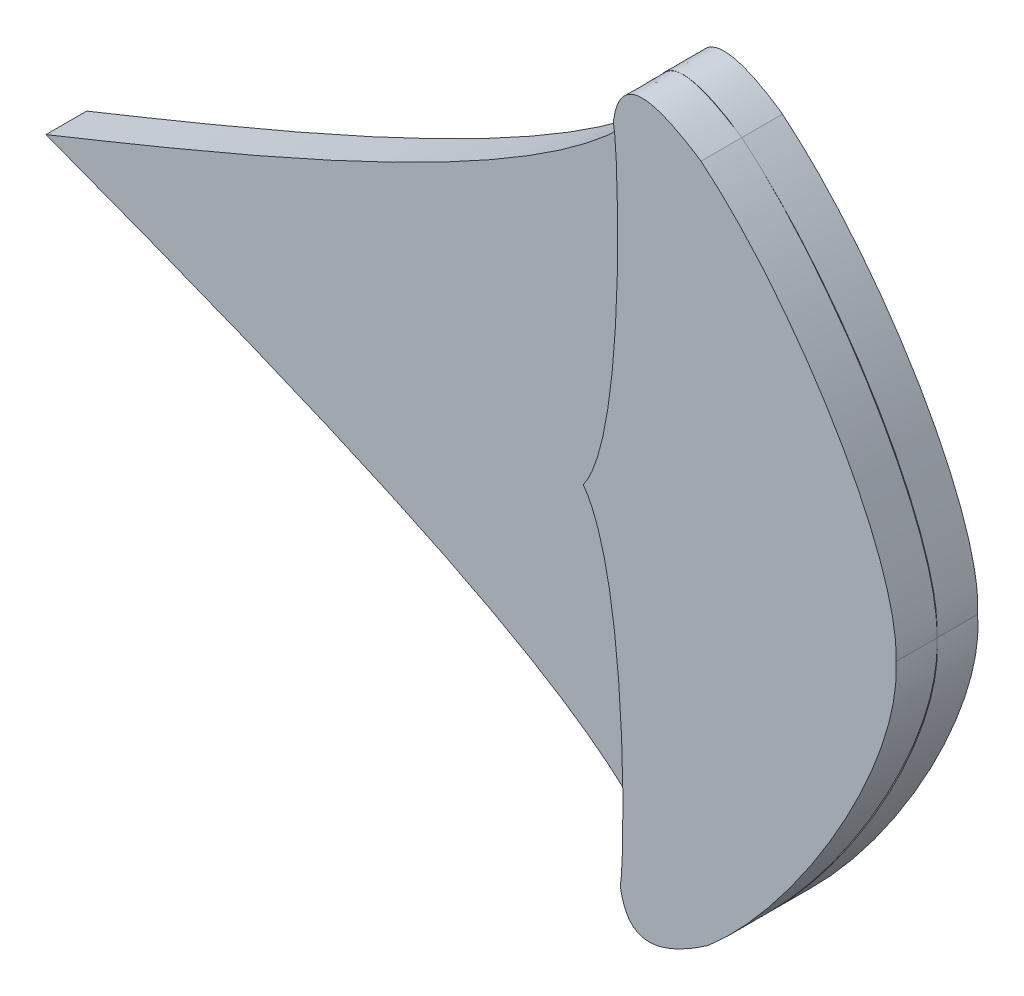
ISO-10303-21;
HEADER;
FILE_DESCRIPTION(('STEP AP214'),'2;1');
FILE_NAME('part.step','',(''),(''),'','','');
FILE_SCHEMA(('AUTOMOTIVE_DESIGN { 1 0 10303 214 1 1 1 1 }'));
ENDSEC;
DATA;
#1=APPLICATION_CONTEXT('core data for automotive mechanical design processes');
#2=APPLICATION_PROTOCOL_DEFINITION('international standard','automotive_design',2000,#1);
#3=PRODUCT_CONTEXT('',#1,'mechanical');
#4=PRODUCT('Part','Part','',(#3));
#5=PRODUCT_RELATED_PRODUCT_CATEGORY('part','',(#4));
#6=PRODUCT_DEFINITION_FORMATION('','',#4);
#7=PRODUCT_DEFINITION_CONTEXT('part definition',#1,'design');
#8=PRODUCT_DEFINITION('design','',#6,#7);
#9=PRODUCT_DEFINITION_SHAPE('','',#8);
#10=(LENGTH_UNIT() NAMED_UNIT(*) SI_UNIT(.MILLI.,.METRE.));
#11=(NAMED_UNIT(*) PLANE_ANGLE_UNIT() SI_UNIT($,.RADIAN.));
#12=(NAMED_UNIT(*) SI_UNIT($,.STERADIAN.) SOLID_ANGLE_UNIT());
#13=UNCERTAINTY_MEASURE_WITH_UNIT(LENGTH_MEASURE(1.E-05),#10,'distance_accuracy_value','');
#14=(GEOMETRIC_REPRESENTATION_CONTEXT(3) GLOBAL_UNCERTAINTY_ASSIGNED_CONTEXT((#13)) GLOBAL_UNIT_ASSIGNED_CONTEXT((#10,
#11,#12)) REPRESENTATION_CONTEXT('',''));
#15=CARTESIAN_POINT('',(0.,0.,0.));
#16=DIRECTION('',(0.,0.,1.));
#17=DIRECTION('',(1.,0.,0.));
#18=AXIS2_PLACEMENT_3D('',#15,#16,#17);
#19=CARTESIAN_POINT('',(1178.25437455071,716.869858079579,10.));
#20=DIRECTION('',(0.,0.,1.));
#21=DIRECTION('',(1.,0.,0.));
#22=AXIS2_PLACEMENT_3D('',#19,#20,#21);
#23=PLANE('',#22);
#24=CARTESIAN_POINT('',(1191.03474698818,757.646716360783,10.));
#25=CARTESIAN_POINT('',(1192.50159578416,777.278635738672,10.));
#26=CARTESIAN_POINT('',(1169.15238179066,818.534015850274,10.));
#27=CARTESIAN_POINT('',(1143.16199509654,840.068602241691,10.));
#28=B_SPLINE_CURVE_WITH_KNOTS('',3,(#24,#25,#26,#27),.UNSPECIFIED.,.F.,.F.,(4,4),(0.,1.),.UNSPECIFIED.);
#29=CARTESIAN_POINT('',(1191.03474698818,757.646716360783,10.));
#30=VERTEX_POINT('',#29);
#31=CARTESIAN_POINT('',(1148.11348934003,835.702837287466,10.));
#32=VERTEX_POINT('',#31);
#33=EDGE_CURVE('E345',#30,#32,#28,.T.);
#34=ORIENTED_EDGE('',*,*,#33,.T.);
#35=CARTESIAN_POINT('',(1143.16199509654,840.068602241691,10.));
#36=CARTESIAN_POINT('',(1166.12732081894,821.245232900632,10.));
#37=CARTESIAN_POINT('',(1191.89734060945,779.592565494833,10.));
#38=CARTESIAN_POINT('',(1191.03474698818,757.646716360783,10.));
#39=B_SPLINE_CURVE_WITH_KNOTS('',3,(#35,#36,#37,#38),.UNSPECIFIED.,.F.,.F.,(4,4),(0.,1.),.UNSPECIFIED.);
#40=EDGE_CURVE('E11',#32,#30,#39,.T.);
#41=ORIENTED_EDGE('',*,*,#40,.T.);
#42=EDGE_LOOP('',(#34,#41));
#43=FACE_BOUND('',#42,.T.);
#44=ADVANCED_FACE('F33',(#43),#23,.T.);
#45=CARTESIAN_POINT('',(1143.16199509654,840.068602241691,10.));
#46=CARTESIAN_POINT('',(1137.274907156,844.24561679532,10.));
#47=CARTESIAN_POINT('',(1123.10699740892,852.788575191911,10.));
#48=CARTESIAN_POINT('',(1121.63502715321,837.715530594909,10.));
#49=B_SPLINE_CURVE_WITH_KNOTS('',3,(#45,#46,#47,#48),.UNSPECIFIED.,.F.,.F.,(4,4),(0.,1.),.UNSPECIFIED.);
#50=CARTESIAN_POINT('',(1143.16199509654,840.068602241691,10.));
#51=VERTEX_POINT('',#50);
#52=CARTESIAN_POINT('',(1121.63502715321,837.715530594909,10.));
#53=VERTEX_POINT('',#52);
#54=EDGE_CURVE('E353',#51,#53,#49,.T.);
#55=ORIENTED_EDGE('',*,*,#54,.T.);
#56=CARTESIAN_POINT('',(1121.63502715321,837.715530594909,10.));
#57=CARTESIAN_POINT('',(1123.13150889634,848.720612205101,10.));
#58=CARTESIAN_POINT('',(1130.20196167157,848.617587303623,10.));
#59=CARTESIAN_POINT('',(1143.16199509654,840.068602241691,10.));
#60=B_SPLINE_CURVE_WITH_KNOTS('',3,(#56,#57,#58,#59),.UNSPECIFIED.,.F.,.F.,(4,4),(0.,1.),.UNSPECIFIED.);
#61=EDGE_CURVE('E270',#53,#51,#60,.T.);
#62=ORIENTED_EDGE('',*,*,#61,.T.);
#63=EDGE_LOOP('',(#55,#62));
#64=FACE_BOUND('',#63,.T.);
#65=ADVANCED_FACE('F382',(#64),#23,.T.);
#66=CARTESIAN_POINT('',(1144.91586145485,674.230794361397,10.));
#67=CARTESIAN_POINT('',(1167.4779509318,693.535652229829,10.));
#68=CARTESIAN_POINT('',(1192.36128528413,735.724019033143,10.));
#69=CARTESIAN_POINT('',(1191.03474698818,757.646716360783,10.));
#70=B_SPLINE_CURVE_WITH_KNOTS('',3,(#66,#67,#68,#69),.UNSPECIFIED.,.F.,.F.,(4,4),(0.,1.),.UNSPECIFIED.);
#71=CARTESIAN_POINT('',(1149.77391567161,678.700303071629,10.));
#72=VERTEX_POINT('',#71);
#73=EDGE_CURVE('E43',#72,#30,#70,.T.);
#74=ORIENTED_EDGE('',*,*,#73,.F.);
#75=CARTESIAN_POINT('',(1144.91586145485,674.230794361397,10.));
#76=CARTESIAN_POINT('',(1170.44499516052,696.310240545526,10.));
#77=CARTESIAN_POINT('',(1192.91646749369,738.05021075929,10.));
#78=CARTESIAN_POINT('',(1191.03474698818,757.646716360783,10.));
#79=B_SPLINE_CURVE_WITH_KNOTS('',3,(#75,#76,#77,#78),.UNSPECIFIED.,.F.,.F.,(4,4),(0.,1.),.UNSPECIFIED.);
#80=EDGE_CURVE('E238',#72,#30,#79,.T.);
#81=ORIENTED_EDGE('',*,*,#80,.T.);
#82=EDGE_LOOP('',(#74,#81));
#83=FACE_BOUND('',#82,.T.);
#84=ADVANCED_FACE('F406',(#83),#23,.T.);
#85=CARTESIAN_POINT('',(972.400775184516,755.334488691884,10.));
#86=CARTESIAN_POINT('',(1034.69237237229,731.818676287723,10.));
#87=CARTESIAN_POINT('',(1108.99229329116,702.765625797766,10.));
#88=CARTESIAN_POINT('',(1123.34394281182,676.12806109716,10.));
#89=B_SPLINE_CURVE_WITH_KNOTS('',3,(#85,#86,#87,#88),.UNSPECIFIED.,.F.,.F.,(4,4),(0.,1.),.UNSPECIFIED.);
#90=CARTESIAN_POINT('',(972.400775184516,755.334488691884,10.));
#91=VERTEX_POINT('',#90);
#92=CARTESIAN_POINT('',(1123.34394281182,676.12806109716,10.));
#93=VERTEX_POINT('',#92);
#94=EDGE_CURVE('E190',#91,#93,#89,.T.);
#95=ORIENTED_EDGE('',*,*,#94,.T.);
#96=CARTESIAN_POINT('',(1123.34394281182,676.12806109716,10.));
#97=CARTESIAN_POINT('',(1124.58590987402,681.688679007175,10.));
#98=CARTESIAN_POINT('',(1125.28108851305,742.213943036616,10.));
#99=CARTESIAN_POINT('',(1114.2662477995,756.83482859028,10.));
#100=B_SPLINE_CURVE_WITH_KNOTS('',3,(#96,#97,#98,#99),.UNSPECIFIED.,.F.,.F.,(4,4),(0.,1.),.UNSPECIFIED.);
#101=CARTESIAN_POINT('',(1114.2662477995,756.83482859028,10.));
#102=VERTEX_POINT('',#101);
#103=EDGE_CURVE('E147',#93,#102,#100,.T.);
#104=ORIENTED_EDGE('',*,*,#103,.T.);
#105=CARTESIAN_POINT('',(1121.63502715321,837.715530594909,10.));
#106=CARTESIAN_POINT('',(1122.99431916133,832.182423062841,10.));
#107=CARTESIAN_POINT('',(1124.96940448789,771.685399192848,10.));
#108=CARTESIAN_POINT('',(1114.2662477995,756.83482859028,10.));
#109=B_SPLINE_CURVE_WITH_KNOTS('',3,(#105,#106,#107,#108),.UNSPECIFIED.,.F.,.F.,(4,4),(0.,1.),.UNSPECIFIED.);
#110=EDGE_CURVE('E144',#53,#102,#109,.T.);
#111=ORIENTED_EDGE('',*,*,#110,.F.);
#112=CARTESIAN_POINT('',(1121.63502715321,837.715530594909,10.));
#113=CARTESIAN_POINT('',(1107.84995140258,810.780397706945,10.));
#114=CARTESIAN_POINT('',(1034.18109851328,780.16246006743,10.));
#115=CARTESIAN_POINT('',(972.400775184516,755.334488691884,10.));
#116=B_SPLINE_CURVE_WITH_KNOTS('',3,(#112,#113,#114,#115),.UNSPECIFIED.,.F.,.F.,(4,4),(0.,1.),.UNSPECIFIED.);
#117=EDGE_CURVE('E368',#53,#91,#116,.T.);
#118=ORIENTED_EDGE('',*,*,#117,.T.);
#119=EDGE_LOOP('',(#95,#104,#111,#118));
#120=FACE_BOUND('',#119,.T.);
#121=ADVANCED_FACE('F172',(#120),#23,.T.);
#122=DIRECTION('',(0.,0.,-1.));
#123=VECTOR('',#122,1.);
#124=SURFACE_OF_LINEAR_EXTRUSION('',#79,#123);
#125=CARTESIAN_POINT('',(1144.91586145485,674.230794361397,0.));
#126=CARTESIAN_POINT('',(1170.44499516052,696.310240545526,0.));
#127=CARTESIAN_POINT('',(1192.91646749369,738.05021075929,0.));
#128=CARTESIAN_POINT('',(1191.03474698818,757.646716360783,0.));
#129=B_SPLINE_CURVE_WITH_KNOTS('',3,(#125,#126,#127,#128),.UNSPECIFIED.,.F.,.F.,(4,4),(0.,1.),.UNSPECIFIED.);
#130=CARTESIAN_POINT('',(1144.91586145485,674.230794361397,0.));
#131=VERTEX_POINT('',#130);
#132=CARTESIAN_POINT('',(1191.03474698818,757.646716360783,0.));
#133=VERTEX_POINT('',#132);
#134=EDGE_CURVE('E195',#131,#133,#129,.T.);
#135=ORIENTED_EDGE('',*,*,#134,.T.);
#136=DIRECTION('',(0.,0.,-1.));
#137=VECTOR('',#136,1.);
#138=CARTESIAN_POINT('',(1191.03474698818,757.646716360783,10.));
#139=LINE('',#138,#137);
#140=EDGE_CURVE('E38',#30,#133,#139,.T.);
#141=ORIENTED_EDGE('',*,*,#140,.F.);
#142=ORIENTED_EDGE('',*,*,#80,.F.);
#143=CARTESIAN_POINT('',(1144.91586145485,674.230794361397,10.));
#144=VERTEX_POINT('',#143);
#145=EDGE_CURVE('E339',#144,#72,#79,.T.);
#146=ORIENTED_EDGE('',*,*,#145,.F.);
#147=DIRECTION('',(0.,0.,-1.));
#148=VECTOR('',#147,1.);
#149=CARTESIAN_POINT('',(1144.91586145485,674.230794361397,10.));
#150=LINE('',#149,#148);
#151=EDGE_CURVE('E189',#144,#131,#150,.T.);
#152=ORIENTED_EDGE('',*,*,#151,.T.);
#153=EDGE_LOOP('',(#135,#141,#142,#146,#152));
#154=FACE_BOUND('',#153,.T.);
#155=ADVANCED_FACE('F35',(#154),#124,.F.);
#156=DIRECTION('',(0.,0.,-1.));
#157=VECTOR('',#156,1.);
#158=SURFACE_OF_LINEAR_EXTRUSION('',#28,#157);
#159=CARTESIAN_POINT('',(1191.03474698818,757.646716360783,0.));
#160=CARTESIAN_POINT('',(1192.50159578416,777.278635738672,0.));
#161=CARTESIAN_POINT('',(1169.15238179066,818.534015850274,0.));
#162=CARTESIAN_POINT('',(1143.16199509654,840.068602241691,0.));
#163=B_SPLINE_CURVE_WITH_KNOTS('',3,(#159,#160,#161,#162),.UNSPECIFIED.,.F.,.F.,(4,4),(0.,1.),.UNSPECIFIED.);
#164=CARTESIAN_POINT('',(1143.16199509654,840.068602241691,0.));
#165=VERTEX_POINT('',#164);
#166=EDGE_CURVE('E203',#133,#165,#163,.T.);
#167=ORIENTED_EDGE('',*,*,#166,.T.);
#168=DIRECTION('',(0.,0.,-1.));
#169=VECTOR('',#168,1.);
#170=CARTESIAN_POINT('',(1143.16199509654,840.068602241691,10.));
#171=LINE('',#170,#169);
#172=EDGE_CURVE('E252',#51,#165,#171,.T.);
#173=ORIENTED_EDGE('',*,*,#172,.F.);
#174=EDGE_CURVE('E52',#32,#51,#28,.T.);
#175=ORIENTED_EDGE('',*,*,#174,.F.);
#176=ORIENTED_EDGE('',*,*,#33,.F.);
#177=ORIENTED_EDGE('',*,*,#140,.T.);
#178=EDGE_LOOP('',(#167,#173,#175,#176,#177));
#179=FACE_BOUND('',#178,.T.);
#180=ADVANCED_FACE('F360',(#179),#158,.F.);
#181=DIRECTION('',(0.,0.,-1.));
#182=VECTOR('',#181,1.);
#183=SURFACE_OF_LINEAR_EXTRUSION('',#49,#182);
#184=CARTESIAN_POINT('',(1143.16199509654,840.068602241691,0.));
#185=CARTESIAN_POINT('',(1137.274907156,844.24561679532,0.));
#186=CARTESIAN_POINT('',(1123.10699740892,852.788575191911,0.));
#187=CARTESIAN_POINT('',(1121.63502715321,837.715530594909,0.));
#188=B_SPLINE_CURVE_WITH_KNOTS('',3,(#184,#185,#186,#187),.UNSPECIFIED.,.F.,.F.,(4,4),(0.,1.),.UNSPECIFIED.);
#189=CARTESIAN_POINT('',(1121.63502715321,837.715530594909,0.));
#190=VERTEX_POINT('',#189);
#191=EDGE_CURVE('E210',#165,#190,#188,.T.);
#192=ORIENTED_EDGE('',*,*,#191,.T.);
#193=DIRECTION('',(0.,0.,-1.));
#194=VECTOR('',#193,1.);
#195=CARTESIAN_POINT('',(1121.63502715321,837.715530594909,10.));
#196=LINE('',#195,#194);
#197=EDGE_CURVE('E250',#53,#190,#196,.T.);
#198=ORIENTED_EDGE('',*,*,#197,.F.);
#199=ORIENTED_EDGE('',*,*,#54,.F.);
#200=ORIENTED_EDGE('',*,*,#172,.T.);
#201=EDGE_LOOP('',(#192,#198,#199,#200));
#202=FACE_BOUND('',#201,.T.);
#203=ADVANCED_FACE('F363',(#202),#183,.F.);
#204=DIRECTION('',(0.,0.,-1.));
#205=VECTOR('',#204,1.);
#206=SURFACE_OF_LINEAR_EXTRUSION('',#116,#205);
#207=CARTESIAN_POINT('',(1121.63502715321,837.715530594909,0.));
#208=CARTESIAN_POINT('',(1107.84995140258,810.780397706945,0.));
#209=CARTESIAN_POINT('',(1034.18109851328,780.16246006743,0.));
#210=CARTESIAN_POINT('',(972.400775184516,755.334488691884,0.));
#211=B_SPLINE_CURVE_WITH_KNOTS('',3,(#207,#208,#209,#210),.UNSPECIFIED.,.F.,.F.,(4,4),(0.,1.),.UNSPECIFIED.);
#212=CARTESIAN_POINT('',(972.400775184516,755.334488691884,0.));
#213=VERTEX_POINT('',#212);
#214=EDGE_CURVE('E217',#190,#213,#211,.T.);
#215=ORIENTED_EDGE('',*,*,#214,.T.);
#216=DIRECTION('',(0.,0.,-1.));
#217=VECTOR('',#216,1.);
#218=CARTESIAN_POINT('',(972.400775184516,755.334488691884,10.));
#219=LINE('',#218,#217);
#220=EDGE_CURVE('E247',#91,#213,#219,.T.);
#221=ORIENTED_EDGE('',*,*,#220,.F.);
#222=ORIENTED_EDGE('',*,*,#117,.F.);
#223=ORIENTED_EDGE('',*,*,#197,.T.);
#224=EDGE_LOOP('',(#215,#221,#222,#223));
#225=FACE_BOUND('',#224,.T.);
#226=ADVANCED_FACE('F365',(#225),#206,.F.);
#227=DIRECTION('',(0.,0.,-1.));
#228=VECTOR('',#227,1.);
#229=SURFACE_OF_LINEAR_EXTRUSION('',#89,#228);
#230=CARTESIAN_POINT('',(972.400775184516,755.334488691884,0.));
#231=CARTESIAN_POINT('',(1034.69237237229,731.818676287723,0.));
#232=CARTESIAN_POINT('',(1108.99229329116,702.765625797766,0.));
#233=CARTESIAN_POINT('',(1123.34394281182,676.12806109716,0.));
#234=B_SPLINE_CURVE_WITH_KNOTS('',3,(#230,#231,#232,#233),.UNSPECIFIED.,.F.,.F.,(4,4),(0.,1.),.UNSPECIFIED.);
#235=CARTESIAN_POINT('',(1123.34394281182,676.12806109716,0.));
#236=VERTEX_POINT('',#235);
#237=EDGE_CURVE('E224',#213,#236,#234,.T.);
#238=ORIENTED_EDGE('',*,*,#237,.T.);
#239=DIRECTION('',(0.,0.,-1.));
#240=VECTOR('',#239,1.);
#241=CARTESIAN_POINT('',(1123.34394281182,676.12806109716,10.));
#242=LINE('',#241,#240);
#243=EDGE_CURVE('E244',#93,#236,#242,.T.);
#244=ORIENTED_EDGE('',*,*,#243,.F.);
#245=ORIENTED_EDGE('',*,*,#94,.F.);
#246=ORIENTED_EDGE('',*,*,#220,.T.);
#247=EDGE_LOOP('',(#238,#244,#245,#246));
#248=FACE_BOUND('',#247,.T.);
#249=ADVANCED_FACE('F180',(#248),#229,.F.);
#250=CARTESIAN_POINT('',(1123.34394281182,676.12806109716,10.));
#251=CARTESIAN_POINT('',(1125.13436698183,661.08951890889,10.));
#252=CARTESIAN_POINT('',(1139.11843088144,669.930206756504,10.));
#253=CARTESIAN_POINT('',(1144.91586145485,674.230794361397,10.));
#254=B_SPLINE_CURVE_WITH_KNOTS('',3,(#250,#251,#252,#253),.UNSPECIFIED.,.F.,.F.,(4,4),(0.,1.),.UNSPECIFIED.);
#255=DIRECTION('',(0.,0.,-1.));
#256=VECTOR('',#255,1.);
#257=SURFACE_OF_LINEAR_EXTRUSION('',#254,#256);
#258=CARTESIAN_POINT('',(1123.34394281182,676.12806109716,0.));
#259=CARTESIAN_POINT('',(1125.13436698183,661.08951890889,0.));
#260=CARTESIAN_POINT('',(1139.11843088144,669.930206756504,0.));
#261=CARTESIAN_POINT('',(1144.91586145485,674.230794361397,0.));
#262=B_SPLINE_CURVE_WITH_KNOTS('',3,(#258,#259,#260,#261),.UNSPECIFIED.,.F.,.F.,(4,4),(0.,1.),.UNSPECIFIED.);
#263=EDGE_CURVE('E231',#236,#131,#262,.T.);
#264=ORIENTED_EDGE('',*,*,#263,.T.);
#265=ORIENTED_EDGE('',*,*,#151,.F.);
#266=EDGE_CURVE('E184',#93,#144,#254,.T.);
#267=ORIENTED_EDGE('',*,*,#266,.F.);
#268=ORIENTED_EDGE('',*,*,#243,.T.);
#269=EDGE_LOOP('',(#264,#265,#267,#268));
#270=FACE_BOUND('',#269,.T.);
#271=ADVANCED_FACE('F170',(#270),#257,.F.);
#272=CARTESIAN_POINT('',(1123.34394281182,676.12806109716,10.));
#273=CARTESIAN_POINT('',(1125.07283873901,665.157090414151,10.));
#274=CARTESIAN_POINT('',(1132.13953117119,665.409626839561,10.));
#275=CARTESIAN_POINT('',(1144.91586145485,674.230794361397,10.));
#276=B_SPLINE_CURVE_WITH_KNOTS('',3,(#272,#273,#274,#275),.UNSPECIFIED.,.F.,.F.,(4,4),(0.,1.),.UNSPECIFIED.);
#277=EDGE_CURVE('E266',#93,#144,#276,.T.);
#278=ORIENTED_EDGE('',*,*,#277,.F.);
#279=ORIENTED_EDGE('',*,*,#266,.T.);
#280=EDGE_LOOP('',(#278,#279));
#281=FACE_BOUND('',#280,.T.);
#282=ADVANCED_FACE('F166',(#281),#23,.T.);
#283=CARTESIAN_POINT('',(1178.25437455071,716.869858079579,0.));
#284=DIRECTION('',(0.,0.,1.));
#285=DIRECTION('',(1.,0.,0.));
#286=AXIS2_PLACEMENT_3D('',#283,#284,#285);
#287=PLANE('',#286);
#288=ORIENTED_EDGE('',*,*,#134,.F.);
#289=ORIENTED_EDGE('',*,*,#263,.F.);
#290=ORIENTED_EDGE('',*,*,#237,.F.);
#291=ORIENTED_EDGE('',*,*,#214,.F.);
#292=ORIENTED_EDGE('',*,*,#191,.F.);
#293=ORIENTED_EDGE('',*,*,#166,.F.);
#294=EDGE_LOOP('',(#288,#289,#290,#291,#292,#293));
#295=FACE_BOUND('',#294,.T.);
#296=ADVANCED_FACE('F169',(#295),#287,.F.);
#297=CARTESIAN_POINT('',(1128.09967924418,846.224841420347,10.));
#298=DIRECTION('',(0.,0.,1.));
#299=DIRECTION('',(1.,0.,0.));
#300=AXIS2_PLACEMENT_3D('',#297,#298,#299);
#301=PLANE('',#300);
#302=EDGE_CURVE('E260',#144,#72,#70,.T.);
#303=ORIENTED_EDGE('',*,*,#302,.F.);
#304=ORIENTED_EDGE('',*,*,#145,.T.);
#305=EDGE_LOOP('',(#303,#304));
#306=FACE_BOUND('',#305,.T.);
#307=ADVANCED_FACE('F175',(#306),#301,.F.);
#308=EDGE_CURVE('E45',#51,#32,#39,.T.);
#309=ORIENTED_EDGE('',*,*,#308,.T.);
#310=ORIENTED_EDGE('',*,*,#174,.T.);
#311=EDGE_LOOP('',(#309,#310));
#312=FACE_BOUND('',#311,.T.);
#313=ADVANCED_FACE('F164',(#312),#301,.F.);
#314=CARTESIAN_POINT('',(1121.63502715321,837.715530594909,20.));
#315=CARTESIAN_POINT('',(1123.13150889634,848.720612205101,20.));
#316=CARTESIAN_POINT('',(1130.20196167157,848.617587303623,20.));
#317=CARTESIAN_POINT('',(1143.16199509654,840.068602241691,20.));
#318=B_SPLINE_CURVE_WITH_KNOTS('',3,(#314,#315,#316,#317),.UNSPECIFIED.,.F.,.F.,(4,4),(0.,1.),.UNSPECIFIED.);
#319=DIRECTION('',(0.,0.,-1.));
#320=VECTOR('',#319,1.);
#321=SURFACE_OF_LINEAR_EXTRUSION('',#318,#320);
#322=ORIENTED_EDGE('',*,*,#61,.F.);
#323=DIRECTION('',(0.,0.,-1.));
#324=VECTOR('',#323,1.);
#325=CARTESIAN_POINT('',(1121.63502715321,837.715530594909,20.));
#326=LINE('',#325,#324);
#327=CARTESIAN_POINT('',(1121.63502715321,837.715530594909,20.));
#328=VERTEX_POINT('',#327);
#329=EDGE_CURVE('E142',#328,#53,#326,.T.);
#330=ORIENTED_EDGE('',*,*,#329,.F.);
#331=CARTESIAN_POINT('',(1143.16199509654,840.068602241691,20.));
#332=VERTEX_POINT('',#331);
#333=EDGE_CURVE('E135',#328,#332,#318,.T.);
#334=ORIENTED_EDGE('',*,*,#333,.T.);
#335=DIRECTION('',(0.,0.,-1.));
#336=VECTOR('',#335,1.);
#337=CARTESIAN_POINT('',(1143.16199509654,840.068602241691,20.));
#338=LINE('',#337,#336);
#339=EDGE_CURVE('E119',#332,#51,#338,.T.);
#340=ORIENTED_EDGE('',*,*,#339,.T.);
#341=EDGE_LOOP('',(#322,#330,#334,#340));
#342=FACE_BOUND('',#341,.T.);
#343=ADVANCED_FACE('F140',(#342),#321,.T.);
#344=CARTESIAN_POINT('',(1121.63502715321,837.715530594909,20.));
#345=CARTESIAN_POINT('',(1122.99431916133,832.182423062841,20.));
#346=CARTESIAN_POINT('',(1124.96940448789,771.685399192848,20.));
#347=CARTESIAN_POINT('',(1114.2662477995,756.83482859028,20.));
#348=B_SPLINE_CURVE_WITH_KNOTS('',3,(#344,#345,#346,#347),.UNSPECIFIED.,.F.,.F.,(4,4),(0.,1.),.UNSPECIFIED.);
#349=DIRECTION('',(0.,0.,-1.));
#350=VECTOR('',#349,1.);
#351=SURFACE_OF_LINEAR_EXTRUSION('',#348,#350);
#352=ORIENTED_EDGE('',*,*,#110,.T.);
#353=DIRECTION('',(0.,0.,-1.));
#354=VECTOR('',#353,1.);
#355=CARTESIAN_POINT('',(1114.2662477995,756.83482859028,20.));
#356=LINE('',#355,#354);
#357=CARTESIAN_POINT('',(1114.2662477995,756.83482859028,20.));
#358=VERTEX_POINT('',#357);
#359=EDGE_CURVE('E330',#358,#102,#356,.T.);
#360=ORIENTED_EDGE('',*,*,#359,.F.);
#361=EDGE_CURVE('E130',#328,#358,#348,.T.);
#362=ORIENTED_EDGE('',*,*,#361,.F.);
#363=ORIENTED_EDGE('',*,*,#329,.T.);
#364=EDGE_LOOP('',(#352,#360,#362,#363));
#365=FACE_BOUND('',#364,.T.);
#366=ADVANCED_FACE('F163',(#365),#351,.F.);
#367=CARTESIAN_POINT('',(1123.34394281182,676.12806109716,20.));
#368=CARTESIAN_POINT('',(1124.58590987402,681.688679007175,20.));
#369=CARTESIAN_POINT('',(1125.28108851305,742.213943036616,20.));
#370=CARTESIAN_POINT('',(1114.2662477995,756.83482859028,20.));
#371=B_SPLINE_CURVE_WITH_KNOTS('',3,(#367,#368,#369,#370),.UNSPECIFIED.,.F.,.F.,(4,4),(0.,1.),.UNSPECIFIED.);
#372=DIRECTION('',(0.,0.,-1.));
#373=VECTOR('',#372,1.);
#374=SURFACE_OF_LINEAR_EXTRUSION('',#371,#373);
#375=ORIENTED_EDGE('',*,*,#103,.F.);
#376=DIRECTION('',(0.,0.,-1.));
#377=VECTOR('',#376,1.);
#378=CARTESIAN_POINT('',(1123.34394281182,676.12806109716,20.));
#379=LINE('',#378,#377);
#380=CARTESIAN_POINT('',(1123.34394281182,676.12806109716,20.));
#381=VERTEX_POINT('',#380);
#382=EDGE_CURVE('E332',#381,#93,#379,.T.);
#383=ORIENTED_EDGE('',*,*,#382,.F.);
#384=EDGE_CURVE('E288',#381,#358,#371,.T.);
#385=ORIENTED_EDGE('',*,*,#384,.T.);
#386=ORIENTED_EDGE('',*,*,#359,.T.);
#387=EDGE_LOOP('',(#375,#383,#385,#386));
#388=FACE_BOUND('',#387,.T.);
#389=ADVANCED_FACE('F300',(#388),#374,.T.);
#390=CARTESIAN_POINT('',(1123.34394281182,676.12806109716,20.));
#391=CARTESIAN_POINT('',(1125.07283873901,665.157090414151,20.));
#392=CARTESIAN_POINT('',(1132.13953117119,665.409626839561,20.));
#393=CARTESIAN_POINT('',(1144.91586145485,674.230794361397,20.));
#394=B_SPLINE_CURVE_WITH_KNOTS('',3,(#390,#391,#392,#393),.UNSPECIFIED.,.F.,.F.,(4,4),(0.,1.),.UNSPECIFIED.);
#395=DIRECTION('',(0.,0.,-1.));
#396=VECTOR('',#395,1.);
#397=SURFACE_OF_LINEAR_EXTRUSION('',#394,#396);
#398=ORIENTED_EDGE('',*,*,#277,.T.);
#399=DIRECTION('',(0.,0.,-1.));
#400=VECTOR('',#399,1.);
#401=CARTESIAN_POINT('',(1144.91586145485,674.230794361397,20.));
#402=LINE('',#401,#400);
#403=CARTESIAN_POINT('',(1144.91586145485,674.230794361397,20.));
#404=VERTEX_POINT('',#403);
#405=EDGE_CURVE('E335',#404,#144,#402,.T.);
#406=ORIENTED_EDGE('',*,*,#405,.F.);
#407=EDGE_CURVE('E310',#381,#404,#394,.T.);
#408=ORIENTED_EDGE('',*,*,#407,.F.);
#409=ORIENTED_EDGE('',*,*,#382,.T.);
#410=EDGE_LOOP('',(#398,#406,#408,#409));
#411=FACE_BOUND('',#410,.T.);
#412=ADVANCED_FACE('F305',(#411),#397,.F.);
#413=CARTESIAN_POINT('',(1144.91586145485,674.230794361397,20.));
#414=CARTESIAN_POINT('',(1167.4779509318,693.535652229829,20.));
#415=CARTESIAN_POINT('',(1192.36128528413,735.724019033143,20.));
#416=CARTESIAN_POINT('',(1191.03474698818,757.646716360783,20.));
#417=B_SPLINE_CURVE_WITH_KNOTS('',3,(#413,#414,#415,#416),.UNSPECIFIED.,.F.,.F.,(4,4),(0.,1.),.UNSPECIFIED.);
#418=DIRECTION('',(0.,0.,-1.));
#419=VECTOR('',#418,1.);
#420=SURFACE_OF_LINEAR_EXTRUSION('',#417,#419);
#421=ORIENTED_EDGE('',*,*,#302,.T.);
#422=ORIENTED_EDGE('',*,*,#73,.T.);
#423=DIRECTION('',(0.,0.,-1.));
#424=VECTOR('',#423,1.);
#425=CARTESIAN_POINT('',(1191.03474698818,757.646716360783,20.));
#426=LINE('',#425,#424);
#427=CARTESIAN_POINT('',(1191.03474698818,757.646716360783,20.));
#428=VERTEX_POINT('',#427);
#429=EDGE_CURVE('E129',#428,#30,#426,.T.);
#430=ORIENTED_EDGE('',*,*,#429,.F.);
#431=EDGE_CURVE('E137',#404,#428,#417,.T.);
#432=ORIENTED_EDGE('',*,*,#431,.F.);
#433=ORIENTED_EDGE('',*,*,#405,.T.);
#434=EDGE_LOOP('',(#421,#422,#430,#432,#433));
#435=FACE_BOUND('',#434,.T.);
#436=ADVANCED_FACE('F308',(#435),#420,.F.);
#437=CARTESIAN_POINT('',(1143.16199509654,840.068602241691,20.));
#438=CARTESIAN_POINT('',(1166.12732081894,821.245232900632,20.));
#439=CARTESIAN_POINT('',(1191.89734060945,779.592565494833,20.));
#440=CARTESIAN_POINT('',(1191.03474698818,757.646716360783,20.));
#441=B_SPLINE_CURVE_WITH_KNOTS('',3,(#437,#438,#439,#440),.UNSPECIFIED.,.F.,.F.,(4,4),(0.,1.),.UNSPECIFIED.);
#442=DIRECTION('',(0.,0.,-1.));
#443=VECTOR('',#442,1.);
#444=SURFACE_OF_LINEAR_EXTRUSION('',#441,#443);
#445=ORIENTED_EDGE('',*,*,#308,.F.);
#446=ORIENTED_EDGE('',*,*,#339,.F.);
#447=EDGE_CURVE('E123',#332,#428,#441,.T.);
#448=ORIENTED_EDGE('',*,*,#447,.T.);
#449=ORIENTED_EDGE('',*,*,#429,.T.);
#450=ORIENTED_EDGE('',*,*,#40,.F.);
#451=EDGE_LOOP('',(#445,#446,#448,#449,#450));
#452=FACE_BOUND('',#451,.T.);
#453=ADVANCED_FACE('F121',(#452),#444,.T.);
#454=CARTESIAN_POINT('',(1128.09967924418,846.224841420347,20.));
#455=DIRECTION('',(0.,0.,1.));
#456=DIRECTION('',(1.,0.,0.));
#457=AXIS2_PLACEMENT_3D('',#454,#455,#456);
#458=PLANE('',#457);
#459=ORIENTED_EDGE('',*,*,#333,.F.);
#460=ORIENTED_EDGE('',*,*,#361,.T.);
#461=ORIENTED_EDGE('',*,*,#384,.F.);
#462=ORIENTED_EDGE('',*,*,#407,.T.);
#463=ORIENTED_EDGE('',*,*,#431,.T.);
#464=ORIENTED_EDGE('',*,*,#447,.F.);
#465=EDGE_LOOP('',(#459,#460,#461,#462,#463,#464));
#466=FACE_BOUND('',#465,.T.);
#467=ADVANCED_FACE('F134',(#466),#458,.T.);
#468=CLOSED_SHELL('',(#44,#65,#84,#121,#155,#180,#203,#226,#249,#271,#282,#296,#307,#313,#343,
#366,#389,#412,#436,#453,#467));
#469=MANIFOLD_SOLID_BREP('B2',#468);
#470=ADVANCED_BREP_SHAPE_REPRESENTATION('',(#18,#469),#14);
#471=SHAPE_DEFINITION_REPRESENTATION(#9,#470);
ENDSEC;
END-ISO-10303-21;
